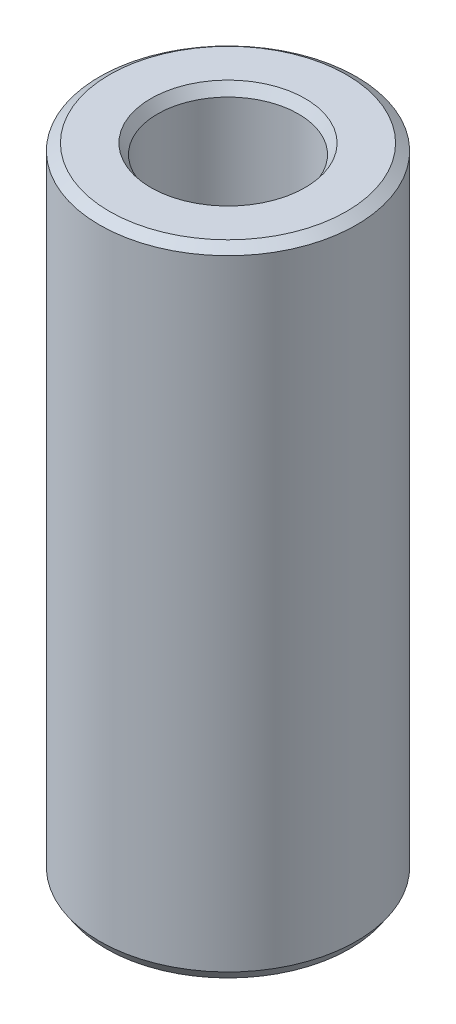
ISO-10303-21;
HEADER;
FILE_DESCRIPTION(('STEP AP214'),'2;1');
FILE_NAME('part.step','',(''),(''),'','','');
FILE_SCHEMA(('AUTOMOTIVE_DESIGN { 1 0 10303 214 1 1 1 1 }'));
ENDSEC;
DATA;
#1=APPLICATION_CONTEXT('core data for automotive mechanical design processes');
#2=APPLICATION_PROTOCOL_DEFINITION('international standard','automotive_design',2000,#1);
#3=PRODUCT_CONTEXT('',#1,'mechanical');
#4=PRODUCT('Part','Part','',(#3));
#5=PRODUCT_RELATED_PRODUCT_CATEGORY('part','',(#4));
#6=PRODUCT_DEFINITION_FORMATION('','',#4);
#7=PRODUCT_DEFINITION_CONTEXT('part definition',#1,'design');
#8=PRODUCT_DEFINITION('design','',#6,#7);
#9=PRODUCT_DEFINITION_SHAPE('','',#8);
#10=(LENGTH_UNIT() NAMED_UNIT(*) SI_UNIT(.MILLI.,.METRE.));
#11=(NAMED_UNIT(*) PLANE_ANGLE_UNIT() SI_UNIT($,.RADIAN.));
#12=(NAMED_UNIT(*) SI_UNIT($,.STERADIAN.) SOLID_ANGLE_UNIT());
#13=UNCERTAINTY_MEASURE_WITH_UNIT(LENGTH_MEASURE(1.E-05),#10,'distance_accuracy_value','');
#14=(GEOMETRIC_REPRESENTATION_CONTEXT(3) GLOBAL_UNCERTAINTY_ASSIGNED_CONTEXT((#13)) GLOBAL_UNIT_ASSIGNED_CONTEXT((#10,
#11,#12)) REPRESENTATION_CONTEXT('',''));
#15=CARTESIAN_POINT('',(0.,0.,0.));
#16=DIRECTION('',(0.,0.,1.));
#17=DIRECTION('',(1.,0.,0.));
#18=AXIS2_PLACEMENT_3D('',#15,#16,#17);
#19=CARTESIAN_POINT('',(0.,235.560540210041,0.));
#20=DIRECTION('',(0.,-1.,0.));
#21=DIRECTION('',(0.,0.,-1.));
#22=AXIS2_PLACEMENT_3D('',#19,#20,#21);
#23=CYLINDRICAL_SURFACE('',#22,47.5);
#24=CARTESIAN_POINT('',(0.,3.68289356222462,0.));
#25=DIRECTION('',(0.,1.,0.));
#26=DIRECTION('',(0.,0.,1.));
#27=AXIS2_PLACEMENT_3D('',#24,#25,#26);
#28=CIRCLE('',#27,47.5);
#29=CARTESIAN_POINT('',(0.,3.68289356222459,-47.5));
#30=VERTEX_POINT('',#29);
#31=EDGE_CURVE('E10',#30,#30,#28,.T.);
#32=CARTESIAN_POINT('',(0.,233.064992181797,0.));
#33=DIRECTION('',(0.,1.,0.));
#34=DIRECTION('',(0.,0.,1.));
#35=AXIS2_PLACEMENT_3D('',#32,#33,#34);
#36=CIRCLE('',#35,47.5);
#37=CARTESIAN_POINT('',(0.,233.064992181797,-47.5));
#38=VERTEX_POINT('',#37);
#39=EDGE_CURVE('E50',#38,#38,#36,.F.);
#40=CARTESIAN_POINT('',(0.,3.68289356222459,-47.5));
#41=CARTESIAN_POINT('',(0.,6.07229042284515,-47.5));
#42=CARTESIAN_POINT('',(0.,8.4616872834657,-47.5));
#43=CARTESIAN_POINT('',(0.,13.2404810047068,-47.5));
#44=CARTESIAN_POINT('',(0.,15.6298778653273,-47.5));
#45=CARTESIAN_POINT('',(0.,20.4086715865684,-47.5));
#46=CARTESIAN_POINT('',(0.,22.798068447189,-47.5));
#47=CARTESIAN_POINT('',(0.,27.5768621684301,-47.5));
#48=CARTESIAN_POINT('',(0.,29.9662590290506,-47.5));
#49=CARTESIAN_POINT('',(0.,34.7450527502917,-47.5));
#50=CARTESIAN_POINT('',(0.,37.1344496109123,-47.5));
#51=CARTESIAN_POINT('',(0.,41.9132433321534,-47.5));
#52=CARTESIAN_POINT('',(0.,44.3026401927739,-47.5));
#53=CARTESIAN_POINT('',(0.,49.081433914015,-47.5));
#54=CARTESIAN_POINT('',(0.,51.4708307746356,-47.5));
#55=CARTESIAN_POINT('',(0.,56.2496244958767,-47.5));
#56=CARTESIAN_POINT('',(0.,58.6390213564972,-47.5));
#57=CARTESIAN_POINT('',(0.,63.4178150777383,-47.5));
#58=CARTESIAN_POINT('',(0.,65.8072119383589,-47.5));
#59=CARTESIAN_POINT('',(0.,70.5860056596,-47.5));
#60=CARTESIAN_POINT('',(0.,72.9754025202205,-47.5));
#61=CARTESIAN_POINT('',(0.,77.7541962414616,-47.5));
#62=CARTESIAN_POINT('',(0.,80.1435931020822,-47.5));
#63=CARTESIAN_POINT('',(0.,84.9223868233233,-47.5));
#64=CARTESIAN_POINT('',(0.,87.3117836839439,-47.5));
#65=CARTESIAN_POINT('',(0.,92.090577405185,-47.5));
#66=CARTESIAN_POINT('',(0.,94.4799742658055,-47.5));
#67=CARTESIAN_POINT('',(0.,99.2587679870466,-47.5));
#68=CARTESIAN_POINT('',(0.,101.648164847667,-47.5));
#69=CARTESIAN_POINT('',(0.,106.426958568908,-47.5));
#70=CARTESIAN_POINT('',(0.,108.816355429529,-47.5));
#71=CARTESIAN_POINT('',(0.,113.59514915077,-47.5));
#72=CARTESIAN_POINT('',(0.,115.98454601139,-47.5));
#73=CARTESIAN_POINT('',(0.,120.763339732632,-47.5));
#74=CARTESIAN_POINT('',(0.,123.152736593252,-47.5));
#75=CARTESIAN_POINT('',(0.,127.931530314493,-47.5));
#76=CARTESIAN_POINT('',(0.,130.320927175114,-47.5));
#77=CARTESIAN_POINT('',(0.,135.099720896355,-47.5));
#78=CARTESIAN_POINT('',(0.,137.489117756975,-47.5));
#79=CARTESIAN_POINT('',(0.,142.267911478216,-47.5));
#80=CARTESIAN_POINT('',(0.,144.657308338837,-47.5));
#81=CARTESIAN_POINT('',(0.,149.436102060078,-47.5));
#82=CARTESIAN_POINT('',(0.,151.825498920699,-47.5));
#83=CARTESIAN_POINT('',(0.,156.60429264194,-47.5));
#84=CARTESIAN_POINT('',(0.,158.99368950256,-47.5));
#85=CARTESIAN_POINT('',(0.,163.772483223801,-47.5));
#86=CARTESIAN_POINT('',(0.,166.161880084422,-47.5));
#87=CARTESIAN_POINT('',(0.,170.940673805663,-47.5));
#88=CARTESIAN_POINT('',(0.,173.330070666284,-47.5));
#89=CARTESIAN_POINT('',(0.,178.108864387525,-47.5));
#90=CARTESIAN_POINT('',(0.,180.498261248145,-47.5));
#91=CARTESIAN_POINT('',(0.,185.277054969386,-47.5));
#92=CARTESIAN_POINT('',(0.,187.666451830007,-47.5));
#93=CARTESIAN_POINT('',(0.,192.445245551248,-47.5));
#94=CARTESIAN_POINT('',(0.,194.834642411869,-47.5));
#95=CARTESIAN_POINT('',(0.,199.61343613311,-47.5));
#96=CARTESIAN_POINT('',(0.,202.00283299373,-47.5));
#97=CARTESIAN_POINT('',(0.,206.781626714971,-47.5));
#98=CARTESIAN_POINT('',(0.,209.171023575592,-47.5));
#99=CARTESIAN_POINT('',(0.,213.949817296833,-47.5));
#100=CARTESIAN_POINT('',(0.,216.339214157454,-47.5));
#101=CARTESIAN_POINT('',(0.,221.118007878695,-47.5));
#102=CARTESIAN_POINT('',(0.,223.507404739315,-47.5));
#103=CARTESIAN_POINT('',(0.,228.286198460556,-47.5));
#104=CARTESIAN_POINT('',(0.,230.675595321177,-47.5));
#105=CARTESIAN_POINT('',(0.,233.064992181797,-47.5));
#106=B_SPLINE_CURVE_WITH_KNOTS('',3,(#40,#41,#42,#43,#44,#45,#46,#47,#48,#49,#50,#51,#52,#53,
#54,#55,#56,#57,#58,#59,#60,#61,#62,#63,#64,#65,#66,#67,#68,#69,#70,#71,#72,#73,#74,#75,#76,#77,
#78,#79,#80,#81,#82,#83,#84,#85,#86,#87,#88,#89,#90,#91,#92,#93,#94,#95,#96,#97,#98,#99,#100,
#101,#102,#103,#104,#105),.UNSPECIFIED.,.F.,.F.,(4,2,2,2,2,2,2,2,2,2,2,2,2,2,2,2,2,2,2,2,2,2,2,
2,2,2,2,2,2,2,2,2,4),(0.,7.16819058186166,14.3363811637233,21.504571745585,28.6727623274466,
35.8409529093082,43.0091434911699,50.1773340730315,57.3455246548932,64.5137152367549,
71.6819058186165,78.8500964004782,86.0182869823398,93.1864775642015,100.354668146063,
107.522858727925,114.691049309786,121.859239891648,129.02743047351,136.195621055371,
143.363811637233,150.532002219095,157.700192800956,164.868383382818,172.03657396468,
179.204764546541,186.372955128403,193.541145710265,200.709336292126,207.877526873988,
215.045717455849,222.213908037711,229.382098619573),.UNSPECIFIED.);
#107=EDGE_CURVE('BSEAM39',#30,#38,#106,.T.);
#108=ORIENTED_EDGE('',*,*,#31,.T.);
#109=ORIENTED_EDGE('',*,*,#39,.T.);
#110=ORIENTED_EDGE('',*,*,#107,.T.);
#111=ORIENTED_EDGE('',*,*,#107,.F.);
#112=EDGE_LOOP('',(#108,#110,#109,#111));
#113=FACE_BOUND('',#112,.T.);
#114=ADVANCED_FACE('F39',(#113),#23,.T.);
#115=CARTESIAN_POINT('',(0.,235.560540210041,0.));
#116=DIRECTION('',(0.,1.,0.));
#117=DIRECTION('',(0.,0.,1.));
#118=AXIS2_PLACEMENT_3D('',#115,#116,#117);
#119=PLANE('',#118);
#120=CARTESIAN_POINT('',(0.,235.560540210041,0.));
#121=DIRECTION('',(0.,1.,0.));
#122=DIRECTION('',(0.,0.,1.));
#123=AXIS2_PLACEMENT_3D('',#120,#121,#122);
#124=CIRCLE('',#123,28.5405046795575);
#125=CARTESIAN_POINT('',(0.,235.560540210041,28.5405046795575));
#126=VERTEX_POINT('',#125);
#127=EDGE_CURVE('E58',#126,#126,#124,.F.);
#128=ORIENTED_EDGE('',*,*,#127,.T.);
#129=EDGE_LOOP('',(#128));
#130=FACE_BOUND('',#129,.T.);
#131=CARTESIAN_POINT('',(0.,235.560540210041,0.));
#132=DIRECTION('',(0.,1.,0.));
#133=DIRECTION('',(0.,0.,1.));
#134=AXIS2_PLACEMENT_3D('',#131,#132,#133);
#135=CIRCLE('',#134,43.8171064377756);
#136=CARTESIAN_POINT('',(0.,235.560540210041,43.8171064377756));
#137=VERTEX_POINT('',#136);
#138=EDGE_CURVE('E61',#137,#137,#135,.T.);
#139=ORIENTED_EDGE('',*,*,#138,.T.);
#140=EDGE_LOOP('',(#139));
#141=FACE_BOUND('',#140,.T.);
#142=ADVANCED_FACE('F88',(#130,#141),#119,.T.);
#143=CARTESIAN_POINT('',(0.,0.,0.));
#144=DIRECTION('',(0.,1.,0.));
#145=DIRECTION('',(0.,0.,1.));
#146=AXIS2_PLACEMENT_3D('',#143,#144,#145);
#147=PLANE('',#146);
#148=CARTESIAN_POINT('',(0.,0.,0.));
#149=DIRECTION('',(0.,1.,0.));
#150=DIRECTION('',(0.,0.,1.));
#151=AXIS2_PLACEMENT_3D('',#148,#149,#150);
#152=CIRCLE('',#151,29.7278502135381);
#153=CARTESIAN_POINT('',(0.,0.,29.7278502135381));
#154=VERTEX_POINT('',#153);
#155=EDGE_CURVE('E51',#154,#154,#152,.T.);
#156=ORIENTED_EDGE('',*,*,#155,.T.);
#157=EDGE_LOOP('',(#156));
#158=FACE_BOUND('',#157,.T.);
#159=CARTESIAN_POINT('',(0.,0.,0.));
#160=DIRECTION('',(0.,1.,0.));
#161=DIRECTION('',(0.,0.,1.));
#162=AXIS2_PLACEMENT_3D('',#159,#160,#161);
#163=CIRCLE('',#162,45.0044519717563);
#164=CARTESIAN_POINT('',(0.,0.,45.0044519717563));
#165=VERTEX_POINT('',#164);
#166=EDGE_CURVE('E54',#165,#165,#163,.F.);
#167=ORIENTED_EDGE('',*,*,#166,.T.);
#168=EDGE_LOOP('',(#167));
#169=FACE_BOUND('',#168,.T.);
#170=ADVANCED_FACE('F83',(#158,#169),#147,.F.);
#171=CARTESIAN_POINT('',(0.,235.560540210041,0.));
#172=DIRECTION('',(0.,-1.,0.));
#173=DIRECTION('',(0.,0.,-1.));
#174=AXIS2_PLACEMENT_3D('',#171,#172,#173);
#175=CYLINDRICAL_SURFACE('',#174,26.0449566513137);
#176=CARTESIAN_POINT('',(0.,231.877646647816,0.));
#177=DIRECTION('',(0.,1.,0.));
#178=DIRECTION('',(0.,0.,1.));
#179=AXIS2_PLACEMENT_3D('',#176,#177,#178);
#180=CIRCLE('',#179,26.0449566513137);
#181=CARTESIAN_POINT('',(0.,231.877646647816,-26.0449566513137));
#182=VERTEX_POINT('',#181);
#183=EDGE_CURVE('E67',#182,#182,#180,.T.);
#184=CARTESIAN_POINT('',(0.,2.49554802824356,0.));
#185=DIRECTION('',(0.,1.,0.));
#186=DIRECTION('',(0.,0.,1.));
#187=AXIS2_PLACEMENT_3D('',#184,#185,#186);
#188=CIRCLE('',#187,26.0449566513137);
#189=CARTESIAN_POINT('',(0.,2.49554802824356,-26.0449566513137));
#190=VERTEX_POINT('',#189);
#191=EDGE_CURVE('E69',#190,#190,#188,.F.);
#192=CARTESIAN_POINT('',(0.,231.877646647816,-26.0449566513137));
#193=CARTESIAN_POINT('',(0.,229.488249787196,-26.0449566513137));
#194=CARTESIAN_POINT('',(0.,227.098852926575,-26.0449566513137));
#195=CARTESIAN_POINT('',(0.,222.320059205334,-26.0449566513137));
#196=CARTESIAN_POINT('',(0.,219.930662344714,-26.0449566513137));
#197=CARTESIAN_POINT('',(0.,215.151868623472,-26.0449566513137));
#198=CARTESIAN_POINT('',(0.,212.762471762852,-26.0449566513137));
#199=CARTESIAN_POINT('',(0.,207.983678041611,-26.0449566513137));
#200=CARTESIAN_POINT('',(0.,205.59428118099,-26.0449566513137));
#201=CARTESIAN_POINT('',(0.,200.815487459749,-26.0449566513137));
#202=CARTESIAN_POINT('',(0.,198.426090599129,-26.0449566513137));
#203=CARTESIAN_POINT('',(0.,193.647296877887,-26.0449566513137));
#204=CARTESIAN_POINT('',(0.,191.257900017267,-26.0449566513137));
#205=CARTESIAN_POINT('',(0.,186.479106296026,-26.0449566513137));
#206=CARTESIAN_POINT('',(0.,184.089709435405,-26.0449566513137));
#207=CARTESIAN_POINT('',(0.,179.310915714164,-26.0449566513137));
#208=CARTESIAN_POINT('',(0.,176.921518853544,-26.0449566513137));
#209=CARTESIAN_POINT('',(0.,172.142725132303,-26.0449566513137));
#210=CARTESIAN_POINT('',(0.,169.753328271682,-26.0449566513137));
#211=CARTESIAN_POINT('',(0.,164.974534550441,-26.0449566513137));
#212=CARTESIAN_POINT('',(0.,162.58513768982,-26.0449566513137));
#213=CARTESIAN_POINT('',(0.,157.806343968579,-26.0449566513137));
#214=CARTESIAN_POINT('',(0.,155.416947107959,-26.0449566513137));
#215=CARTESIAN_POINT('',(0.,150.638153386718,-26.0449566513137));
#216=CARTESIAN_POINT('',(0.,148.248756526097,-26.0449566513137));
#217=CARTESIAN_POINT('',(0.,143.469962804856,-26.0449566513137));
#218=CARTESIAN_POINT('',(0.,141.080565944235,-26.0449566513137));
#219=CARTESIAN_POINT('',(0.,136.301772222994,-26.0449566513137));
#220=CARTESIAN_POINT('',(0.,133.912375362374,-26.0449566513137));
#221=CARTESIAN_POINT('',(0.,129.133581641133,-26.0449566513137));
#222=CARTESIAN_POINT('',(0.,126.744184780512,-26.0449566513137));
#223=CARTESIAN_POINT('',(0.,121.965391059271,-26.0449566513137));
#224=CARTESIAN_POINT('',(0.,119.57599419865,-26.0449566513137));
#225=CARTESIAN_POINT('',(0.,114.797200477409,-26.0449566513137));
#226=CARTESIAN_POINT('',(0.,112.407803616789,-26.0449566513137));
#227=CARTESIAN_POINT('',(0.,107.629009895548,-26.0449566513137));
#228=CARTESIAN_POINT('',(0.,105.239613034927,-26.0449566513137));
#229=CARTESIAN_POINT('',(0.,100.460819313686,-26.0449566513137));
#230=CARTESIAN_POINT('',(0.,98.0714224530655,-26.0449566513137));
#231=CARTESIAN_POINT('',(0.,93.2926287318244,-26.0449566513137));
#232=CARTESIAN_POINT('',(0.,90.9032318712039,-26.0449566513137));
#233=CARTESIAN_POINT('',(0.,86.1244381499628,-26.0449566513137));
#234=CARTESIAN_POINT('',(0.,83.7350412893422,-26.0449566513137));
#235=CARTESIAN_POINT('',(0.,78.9562475681011,-26.0449566513137));
#236=CARTESIAN_POINT('',(0.,76.5668507074806,-26.0449566513137));
#237=CARTESIAN_POINT('',(0.,71.7880569862395,-26.0449566513137));
#238=CARTESIAN_POINT('',(0.,69.3986601256189,-26.0449566513137));
#239=CARTESIAN_POINT('',(0.,64.6198664043778,-26.0449566513137));
#240=CARTESIAN_POINT('',(0.,62.2304695437573,-26.0449566513137));
#241=CARTESIAN_POINT('',(0.,57.4516758225162,-26.0449566513137));
#242=CARTESIAN_POINT('',(0.,55.0622789618956,-26.0449566513137));
#243=CARTESIAN_POINT('',(0.,50.2834852406545,-26.0449566513137));
#244=CARTESIAN_POINT('',(0.,47.894088380034,-26.0449566513137));
#245=CARTESIAN_POINT('',(0.,43.1152946587929,-26.0449566513137));
#246=CARTESIAN_POINT('',(0.,40.7258977981724,-26.0449566513137));
#247=CARTESIAN_POINT('',(0.,35.9471040769313,-26.0449566513137));
#248=CARTESIAN_POINT('',(0.,33.5577072163107,-26.0449566513137));
#249=CARTESIAN_POINT('',(0.,28.7789134950696,-26.0449566513137));
#250=CARTESIAN_POINT('',(0.,26.3895166344491,-26.0449566513137));
#251=CARTESIAN_POINT('',(0.,21.610722913208,-26.0449566513137));
#252=CARTESIAN_POINT('',(0.,19.2213260525874,-26.0449566513137));
#253=CARTESIAN_POINT('',(0.,14.4425323313463,-26.0449566513137));
#254=CARTESIAN_POINT('',(0.,12.0531354707258,-26.0449566513137));
#255=CARTESIAN_POINT('',(0.,7.27434174948467,-26.0449566513137));
#256=CARTESIAN_POINT('',(0.,4.88494488886411,-26.0449566513137));
#257=CARTESIAN_POINT('',(0.,2.49554802824356,-26.0449566513137));
#258=B_SPLINE_CURVE_WITH_KNOTS('',3,(#192,#193,#194,#195,#196,#197,#198,#199,#200,#201,#202,
#203,#204,#205,#206,#207,#208,#209,#210,#211,#212,#213,#214,#215,#216,#217,#218,#219,#220,#221,
#222,#223,#224,#225,#226,#227,#228,#229,#230,#231,#232,#233,#234,#235,#236,#237,#238,#239,#240,
#241,#242,#243,#244,#245,#246,#247,#248,#249,#250,#251,#252,#253,#254,#255,#256,#257),
.UNSPECIFIED.,.F.,.F.,(4,2,2,2,2,2,2,2,2,2,2,2,2,2,2,2,2,2,2,2,2,2,2,2,2,2,2,2,2,2,2,2,4),(0.,
7.16819058186163,14.3363811637233,21.5045717455849,28.6727623274466,35.8409529093082,
43.0091434911699,50.1773340730315,57.3455246548931,64.5137152367548,71.6819058186165,
78.8500964004781,86.0182869823397,93.1864775642014,100.354668146063,107.522858727925,
114.691049309786,121.859239891648,129.02743047351,136.195621055371,143.363811637233,
150.532002219095,157.700192800956,164.868383382818,172.03657396468,179.204764546541,
186.372955128403,193.541145710264,200.709336292126,207.877526873988,215.045717455849,
222.213908037711,229.382098619573),.UNSPECIFIED.);
#259=EDGE_CURVE('BSEAM71',#182,#190,#258,.T.);
#260=ORIENTED_EDGE('',*,*,#183,.T.);
#261=ORIENTED_EDGE('',*,*,#191,.T.);
#262=ORIENTED_EDGE('',*,*,#259,.T.);
#263=ORIENTED_EDGE('',*,*,#259,.F.);
#264=EDGE_LOOP('',(#260,#262,#261,#263));
#265=FACE_BOUND('',#264,.T.);
#266=ADVANCED_FACE('F71',(#265),#175,.F.);
#267=CARTESIAN_POINT('',(0.,231.877646647816,0.));
#268=DIRECTION('',(0.,1.,0.));
#269=DIRECTION('',(0.,0.,1.));
#270=AXIS2_PLACEMENT_3D('',#267,#268,#269);
#271=CONICAL_SURFACE('',#270,26.0449566513137,0.59553728904426);
#272=ORIENTED_EDGE('',*,*,#127,.F.);
#273=EDGE_LOOP('',(#272));
#274=FACE_BOUND('',#273,.T.);
#275=ORIENTED_EDGE('',*,*,#183,.F.);
#276=EDGE_LOOP('',(#275));
#277=FACE_BOUND('',#276,.T.);
#278=ADVANCED_FACE('F77',(#274,#277),#271,.F.);
#279=CARTESIAN_POINT('',(0.,0.,0.));
#280=DIRECTION('',(0.,-1.,0.));
#281=DIRECTION('',(0.,0.,-1.));
#282=AXIS2_PLACEMENT_3D('',#279,#280,#281);
#283=CONICAL_SURFACE('',#282,29.7278502135381,0.975259037750638);
#284=ORIENTED_EDGE('',*,*,#191,.F.);
#285=EDGE_LOOP('',(#284));
#286=FACE_BOUND('',#285,.T.);
#287=ORIENTED_EDGE('',*,*,#155,.F.);
#288=EDGE_LOOP('',(#287));
#289=FACE_BOUND('',#288,.T.);
#290=ADVANCED_FACE('F73',(#286,#289),#283,.F.);
#291=CARTESIAN_POINT('',(0.,3.68289356222462,0.));
#292=DIRECTION('',(0.,1.,0.));
#293=DIRECTION('',(0.,0.,1.));
#294=AXIS2_PLACEMENT_3D('',#291,#292,#293);
#295=CONICAL_SURFACE('',#294,47.5,0.595537289044261);
#296=ORIENTED_EDGE('',*,*,#166,.F.);
#297=EDGE_LOOP('',(#296));
#298=FACE_BOUND('',#297,.T.);
#299=ORIENTED_EDGE('',*,*,#31,.F.);
#300=EDGE_LOOP('',(#299));
#301=FACE_BOUND('',#300,.T.);
#302=ADVANCED_FACE('F76',(#298,#301),#295,.T.);
#303=CARTESIAN_POINT('',(0.,235.560540210041,0.));
#304=DIRECTION('',(0.,-1.,0.));
#305=DIRECTION('',(0.,0.,-1.));
#306=AXIS2_PLACEMENT_3D('',#303,#304,#305);
#307=CONICAL_SURFACE('',#306,43.8171064377756,0.975259037750629);
#308=ORIENTED_EDGE('',*,*,#39,.F.);
#309=EDGE_LOOP('',(#308));
#310=FACE_BOUND('',#309,.T.);
#311=ORIENTED_EDGE('',*,*,#138,.F.);
#312=EDGE_LOOP('',(#311));
#313=FACE_BOUND('',#312,.T.);
#314=ADVANCED_FACE('F45',(#310,#313),#307,.T.);
#315=CLOSED_SHELL('',(#114,#142,#170,#266,#278,#290,#302,#314));
#316=MANIFOLD_SOLID_BREP('B2',#315);
#317=ADVANCED_BREP_SHAPE_REPRESENTATION('',(#18,#316),#14);
#318=SHAPE_DEFINITION_REPRESENTATION(#9,#317);
ENDSEC;
END-ISO-10303-21;
